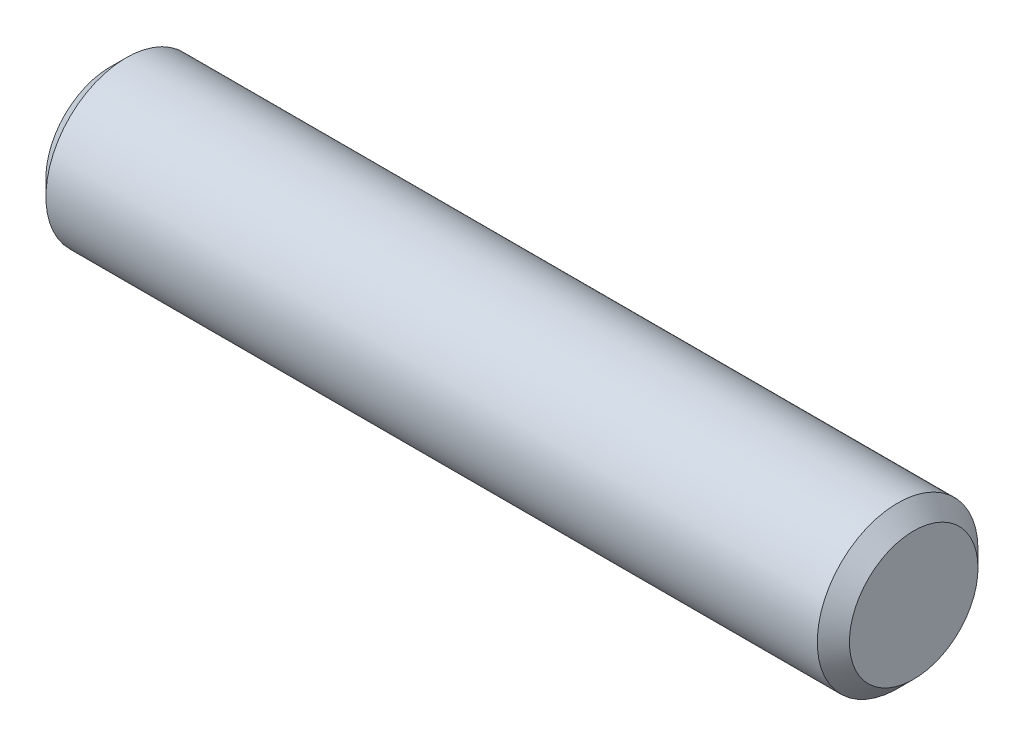
ISO-10303-21;
HEADER;
FILE_DESCRIPTION(('STEP AP214'),'2;1');
FILE_NAME('part.step','',(''),(''),'','','');
FILE_SCHEMA(('AUTOMOTIVE_DESIGN { 1 0 10303 214 1 1 1 1 }'));
ENDSEC;
DATA;
#1=APPLICATION_CONTEXT('core data for automotive mechanical design processes');
#2=APPLICATION_PROTOCOL_DEFINITION('international standard','automotive_design',2000,#1);
#3=PRODUCT_CONTEXT('',#1,'mechanical');
#4=PRODUCT('Part','Part','',(#3));
#5=PRODUCT_RELATED_PRODUCT_CATEGORY('part','',(#4));
#6=PRODUCT_DEFINITION_FORMATION('','',#4);
#7=PRODUCT_DEFINITION_CONTEXT('part definition',#1,'design');
#8=PRODUCT_DEFINITION('design','',#6,#7);
#9=PRODUCT_DEFINITION_SHAPE('','',#8);
#10=(LENGTH_UNIT() NAMED_UNIT(*) SI_UNIT(.MILLI.,.METRE.));
#11=(NAMED_UNIT(*) PLANE_ANGLE_UNIT() SI_UNIT($,.RADIAN.));
#12=(NAMED_UNIT(*) SI_UNIT($,.STERADIAN.) SOLID_ANGLE_UNIT());
#13=UNCERTAINTY_MEASURE_WITH_UNIT(LENGTH_MEASURE(1.E-05),#10,'distance_accuracy_value','');
#14=(GEOMETRIC_REPRESENTATION_CONTEXT(3) GLOBAL_UNCERTAINTY_ASSIGNED_CONTEXT((#13)) GLOBAL_UNIT_ASSIGNED_CONTEXT((#10,
#11,#12)) REPRESENTATION_CONTEXT('',''));
#15=CARTESIAN_POINT('',(0.,0.,0.));
#16=DIRECTION('',(0.,0.,1.));
#17=DIRECTION('',(1.,0.,0.));
#18=AXIS2_PLACEMENT_3D('',#15,#16,#17);
#19=CARTESIAN_POINT('',(-7.9375,0.,0.));
#20=DIRECTION('',(1.,0.,0.));
#21=DIRECTION('',(0.,0.,-1.));
#22=AXIS2_PLACEMENT_3D('',#19,#20,#21);
#23=CYLINDRICAL_SURFACE('',#22,1.5875);
#24=CARTESIAN_POINT('',(7.62,0.,0.));
#25=DIRECTION('',(1.,0.,0.));
#26=DIRECTION('',(0.,0.,-1.));
#27=AXIS2_PLACEMENT_3D('',#24,#25,#26);
#28=CIRCLE('',#27,1.5875);
#29=CARTESIAN_POINT('',(7.62,0.,-1.5875));
#30=VERTEX_POINT('',#29);
#31=EDGE_CURVE('E43',#30,#30,#28,.F.);
#32=ORIENTED_EDGE('',*,*,#31,.T.);
#33=EDGE_LOOP('',(#32));
#34=FACE_BOUND('',#33,.T.);
#35=CARTESIAN_POINT('',(-7.62,0.,0.));
#36=DIRECTION('',(1.,0.,0.));
#37=DIRECTION('',(0.,0.,-1.));
#38=AXIS2_PLACEMENT_3D('',#35,#36,#37);
#39=CIRCLE('',#38,1.5875);
#40=CARTESIAN_POINT('',(-7.62,0.,-1.5875));
#41=VERTEX_POINT('',#40);
#42=EDGE_CURVE('E49',#41,#41,#39,.T.);
#43=ORIENTED_EDGE('',*,*,#42,.T.);
#44=EDGE_LOOP('',(#43));
#45=FACE_BOUND('',#44,.T.);
#46=ADVANCED_FACE('F35',(#34,#45),#23,.T.);
#47=CARTESIAN_POINT('',(-7.9375,0.,0.));
#48=DIRECTION('',(1.,0.,0.));
#49=DIRECTION('',(0.,0.,-1.));
#50=AXIS2_PLACEMENT_3D('',#47,#48,#49);
#51=PLANE('',#50);
#52=CARTESIAN_POINT('',(-7.9375,0.,0.));
#53=DIRECTION('',(1.,0.,0.));
#54=DIRECTION('',(0.,0.,-1.));
#55=AXIS2_PLACEMENT_3D('',#52,#53,#54);
#56=CIRCLE('',#55,1.27);
#57=CARTESIAN_POINT('',(-7.9375,0.,-1.27));
#58=VERTEX_POINT('',#57);
#59=EDGE_CURVE('E10',#58,#58,#56,.F.);
#60=ORIENTED_EDGE('',*,*,#59,.T.);
#61=EDGE_LOOP('',(#60));
#62=FACE_BOUND('',#61,.T.);
#63=ADVANCED_FACE('F70',(#62),#51,.F.);
#64=CARTESIAN_POINT('',(7.9375,0.,0.));
#65=DIRECTION('',(1.,0.,0.));
#66=DIRECTION('',(0.,0.,-1.));
#67=AXIS2_PLACEMENT_3D('',#64,#65,#66);
#68=PLANE('',#67);
#69=CARTESIAN_POINT('',(7.9375,0.,0.));
#70=DIRECTION('',(1.,0.,0.));
#71=DIRECTION('',(0.,0.,-1.));
#72=AXIS2_PLACEMENT_3D('',#69,#70,#71);
#73=CIRCLE('',#72,1.27);
#74=CARTESIAN_POINT('',(7.9375,0.,-1.27));
#75=VERTEX_POINT('',#74);
#76=EDGE_CURVE('E54',#75,#75,#73,.T.);
#77=ORIENTED_EDGE('',*,*,#76,.T.);
#78=EDGE_LOOP('',(#77));
#79=FACE_BOUND('',#78,.T.);
#80=ADVANCED_FACE('F60',(#79),#68,.T.);
#81=CARTESIAN_POINT('',(7.9375,0.,0.));
#82=DIRECTION('',(-1.,0.,0.));
#83=DIRECTION('',(0.,0.,1.));
#84=AXIS2_PLACEMENT_3D('',#81,#82,#83);
#85=CONICAL_SURFACE('',#84,1.27,0.785398163397445);
#86=ORIENTED_EDGE('',*,*,#31,.F.);
#87=EDGE_LOOP('',(#86));
#88=FACE_BOUND('',#87,.T.);
#89=ORIENTED_EDGE('',*,*,#76,.F.);
#90=EDGE_LOOP('',(#89));
#91=FACE_BOUND('',#90,.T.);
#92=ADVANCED_FACE('F62',(#88,#91),#85,.T.);
#93=CARTESIAN_POINT('',(-7.62,0.,0.));
#94=DIRECTION('',(1.,0.,0.));
#95=DIRECTION('',(0.,0.,-1.));
#96=AXIS2_PLACEMENT_3D('',#93,#94,#95);
#97=CONICAL_SURFACE('',#96,1.5875,0.78539816339745);
#98=ORIENTED_EDGE('',*,*,#59,.F.);
#99=EDGE_LOOP('',(#98));
#100=FACE_BOUND('',#99,.T.);
#101=ORIENTED_EDGE('',*,*,#42,.F.);
#102=EDGE_LOOP('',(#101));
#103=FACE_BOUND('',#102,.T.);
#104=ADVANCED_FACE('F37',(#100,#103),#97,.T.);
#105=CLOSED_SHELL('',(#46,#63,#80,#92,#104));
#106=MANIFOLD_SOLID_BREP('B2',#105);
#107=ADVANCED_BREP_SHAPE_REPRESENTATION('',(#18,#106),#14);
#108=SHAPE_DEFINITION_REPRESENTATION(#9,#107);
ENDSEC;
END-ISO-10303-21;
